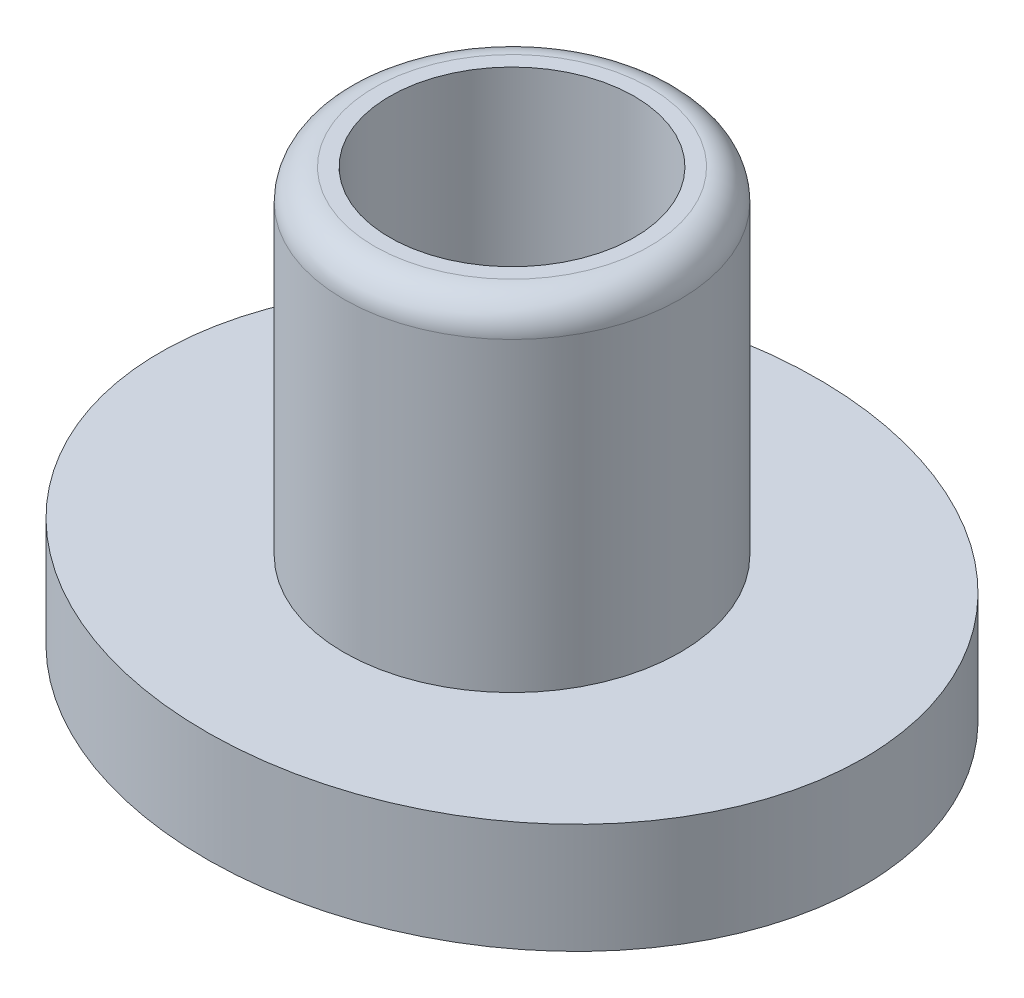
ISO-10303-21;
HEADER;
FILE_DESCRIPTION(('STEP AP214'),'2;1');
FILE_NAME('part.step','',(''),(''),'','','');
FILE_SCHEMA(('AUTOMOTIVE_DESIGN { 1 0 10303 214 1 1 1 1 }'));
ENDSEC;
DATA;
#1=APPLICATION_CONTEXT('core data for automotive mechanical design processes');
#2=APPLICATION_PROTOCOL_DEFINITION('international standard','automotive_design',2000,#1);
#3=PRODUCT_CONTEXT('',#1,'mechanical');
#4=PRODUCT('Part','Part','',(#3));
#5=PRODUCT_RELATED_PRODUCT_CATEGORY('part','',(#4));
#6=PRODUCT_DEFINITION_FORMATION('','',#4);
#7=PRODUCT_DEFINITION_CONTEXT('part definition',#1,'design');
#8=PRODUCT_DEFINITION('design','',#6,#7);
#9=PRODUCT_DEFINITION_SHAPE('','',#8);
#10=(LENGTH_UNIT() NAMED_UNIT(*) SI_UNIT(.MILLI.,.METRE.));
#11=(NAMED_UNIT(*) PLANE_ANGLE_UNIT() SI_UNIT($,.RADIAN.));
#12=(NAMED_UNIT(*) SI_UNIT($,.STERADIAN.) SOLID_ANGLE_UNIT());
#13=UNCERTAINTY_MEASURE_WITH_UNIT(LENGTH_MEASURE(1.E-05),#10,'distance_accuracy_value','');
#14=(GEOMETRIC_REPRESENTATION_CONTEXT(3) GLOBAL_UNCERTAINTY_ASSIGNED_CONTEXT((#13)) GLOBAL_UNIT_ASSIGNED_CONTEXT((#10,
#11,#12)) REPRESENTATION_CONTEXT('',''));
#15=CARTESIAN_POINT('',(0.,0.,0.));
#16=DIRECTION('',(0.,0.,1.));
#17=DIRECTION('',(1.,0.,0.));
#18=AXIS2_PLACEMENT_3D('',#15,#16,#17);
#19=CARTESIAN_POINT('',(0.,1.8,0.));
#20=DIRECTION('',(0.,1.,0.));
#21=DIRECTION('',(0.,0.,-1.));
#22=AXIS2_PLACEMENT_3D('',#19,#20,#21);
#23=PLANE('',#22);
#24=CARTESIAN_POINT('',(0.,1.8,0.));
#25=DIRECTION('',(0.,-1.,0.));
#26=DIRECTION('',(1.,0.,0.));
#27=AXIS2_PLACEMENT_3D('',#24,#25,#26);
#28=ELLIPSE('',#27,5.75,5.);
#29=CARTESIAN_POINT('',(5.75,1.8,0.));
#30=VERTEX_POINT('',#29);
#31=EDGE_CURVE('E53',#30,#30,#28,.T.);
#32=ORIENTED_EDGE('',*,*,#31,.F.);
#33=EDGE_LOOP('',(#32));
#34=FACE_BOUND('',#33,.T.);
#35=CARTESIAN_POINT('',(0.,1.8,0.));
#36=DIRECTION('',(0.,-1.,0.));
#37=DIRECTION('',(0.,0.,-1.));
#38=AXIS2_PLACEMENT_3D('',#35,#36,#37);
#39=CIRCLE('',#38,2.75);
#40=CARTESIAN_POINT('',(0.,1.8,-2.75));
#41=VERTEX_POINT('',#40);
#42=EDGE_CURVE('E57',#41,#41,#39,.T.);
#43=ORIENTED_EDGE('',*,*,#42,.T.);
#44=EDGE_LOOP('',(#43));
#45=FACE_BOUND('',#44,.T.);
#46=ADVANCED_FACE('F33',(#34,#45),#23,.T.);
#47=DIRECTION('',(0.,-1.,0.));
#48=VECTOR('',#47,1.);
#49=SURFACE_OF_LINEAR_EXTRUSION('',#28,#48);
#50=ORIENTED_EDGE('',*,*,#31,.T.);
#51=EDGE_LOOP('',(#50));
#52=FACE_BOUND('',#51,.T.);
#53=CARTESIAN_POINT('',(0.,0.,0.));
#54=DIRECTION('',(0.,-1.,0.));
#55=DIRECTION('',(1.,0.,0.));
#56=AXIS2_PLACEMENT_3D('',#53,#54,#55);
#57=ELLIPSE('',#56,5.75,5.);
#58=CARTESIAN_POINT('',(5.75,0.,0.));
#59=VERTEX_POINT('',#58);
#60=EDGE_CURVE('E54',#59,#59,#57,.T.);
#61=ORIENTED_EDGE('',*,*,#60,.F.);
#62=EDGE_LOOP('',(#61));
#63=FACE_BOUND('',#62,.T.);
#64=ADVANCED_FACE('F63',(#52,#63),#49,.T.);
#65=CARTESIAN_POINT('',(0.,0.,0.));
#66=DIRECTION('',(0.,1.,0.));
#67=DIRECTION('',(0.,0.,-1.));
#68=AXIS2_PLACEMENT_3D('',#65,#66,#67);
#69=PLANE('',#68);
#70=CARTESIAN_POINT('',(0.,0.,0.));
#71=DIRECTION('',(0.,-1.,0.));
#72=DIRECTION('',(0.,0.,-1.));
#73=AXIS2_PLACEMENT_3D('',#70,#71,#72);
#74=CIRCLE('',#73,2.25);
#75=CARTESIAN_POINT('',(0.,0.,-2.25));
#76=VERTEX_POINT('',#75);
#77=EDGE_CURVE('E48',#76,#76,#74,.T.);
#78=ORIENTED_EDGE('',*,*,#77,.F.);
#79=EDGE_LOOP('',(#78));
#80=FACE_BOUND('',#79,.T.);
#81=ORIENTED_EDGE('',*,*,#60,.T.);
#82=EDGE_LOOP('',(#81));
#83=FACE_BOUND('',#82,.T.);
#84=ADVANCED_FACE('F66',(#80,#83),#69,.F.);
#85=CARTESIAN_POINT('',(0.,7.3,0.));
#86=DIRECTION('',(0.,-1.,0.));
#87=DIRECTION('',(0.,0.,1.));
#88=AXIS2_PLACEMENT_3D('',#85,#86,#87);
#89=CYLINDRICAL_SURFACE('',#88,2.75);
#90=CARTESIAN_POINT('',(0.,6.8,0.));
#91=DIRECTION('',(0.,-1.,0.));
#92=DIRECTION('',(0.,0.,-1.));
#93=AXIS2_PLACEMENT_3D('',#90,#91,#92);
#94=CIRCLE('',#93,2.75);
#95=CARTESIAN_POINT('',(0.,6.8,-2.75));
#96=VERTEX_POINT('',#95);
#97=EDGE_CURVE('E10',#96,#96,#94,.F.);
#98=ORIENTED_EDGE('',*,*,#97,.F.);
#99=EDGE_LOOP('',(#98));
#100=FACE_BOUND('',#99,.T.);
#101=ORIENTED_EDGE('',*,*,#42,.F.);
#102=EDGE_LOOP('',(#101));
#103=FACE_BOUND('',#102,.T.);
#104=ADVANCED_FACE('F88',(#100,#103),#89,.T.);
#105=CARTESIAN_POINT('',(0.,7.3,0.));
#106=DIRECTION('',(0.,1.,0.));
#107=DIRECTION('',(0.,0.,-1.));
#108=AXIS2_PLACEMENT_3D('',#105,#106,#107);
#109=PLANE('',#108);
#110=CARTESIAN_POINT('',(0.,7.3,0.));
#111=DIRECTION('',(0.,-1.,0.));
#112=DIRECTION('',(0.,0.,-1.));
#113=AXIS2_PLACEMENT_3D('',#110,#111,#112);
#114=CIRCLE('',#113,2.25);
#115=CARTESIAN_POINT('',(0.,7.3,-2.25));
#116=VERTEX_POINT('',#115);
#117=EDGE_CURVE('E40',#116,#116,#114,.T.);
#118=ORIENTED_EDGE('',*,*,#117,.F.);
#119=EDGE_LOOP('',(#118));
#120=FACE_BOUND('',#119,.T.);
#121=CARTESIAN_POINT('',(0.,7.3,0.));
#122=DIRECTION('',(0.,-1.,0.));
#123=DIRECTION('',(0.,0.,-1.));
#124=AXIS2_PLACEMENT_3D('',#121,#122,#123);
#125=CIRCLE('',#124,2.);
#126=CARTESIAN_POINT('',(0.,7.3,-2.));
#127=VERTEX_POINT('',#126);
#128=EDGE_CURVE('E99',#127,#127,#125,.T.);
#129=ORIENTED_EDGE('',*,*,#128,.T.);
#130=EDGE_LOOP('',(#129));
#131=FACE_BOUND('',#130,.T.);
#132=ADVANCED_FACE('F77',(#120,#131),#109,.T.);
#133=CARTESIAN_POINT('',(0.,0.,0.));
#134=DIRECTION('',(0.,1.,0.));
#135=DIRECTION('',(0.,0.,-1.));
#136=AXIS2_PLACEMENT_3D('',#133,#134,#135);
#137=CYLINDRICAL_SURFACE('',#136,2.);
#138=CARTESIAN_POINT('',(0.,0.25,0.));
#139=DIRECTION('',(0.,-1.,0.));
#140=DIRECTION('',(0.,0.,-1.));
#141=AXIS2_PLACEMENT_3D('',#138,#139,#140);
#142=CIRCLE('',#141,2.);
#143=CARTESIAN_POINT('',(0.,0.25,-2.));
#144=VERTEX_POINT('',#143);
#145=EDGE_CURVE('E44',#144,#144,#142,.F.);
#146=ORIENTED_EDGE('',*,*,#145,.F.);
#147=EDGE_LOOP('',(#146));
#148=FACE_BOUND('',#147,.T.);
#149=ORIENTED_EDGE('',*,*,#128,.F.);
#150=EDGE_LOOP('',(#149));
#151=FACE_BOUND('',#150,.T.);
#152=ADVANCED_FACE('F71',(#148,#151),#137,.F.);
#153=CARTESIAN_POINT('',(0.,0.25,0.));
#154=DIRECTION('',(0.,1.,0.));
#155=DIRECTION('',(0.,0.,-1.));
#156=AXIS2_PLACEMENT_3D('',#153,#154,#155);
#157=TOROIDAL_SURFACE('',#156,2.25,0.25);
#158=ORIENTED_EDGE('',*,*,#145,.T.);
#159=EDGE_LOOP('',(#158));
#160=FACE_BOUND('',#159,.T.);
#161=ORIENTED_EDGE('',*,*,#77,.T.);
#162=EDGE_LOOP('',(#161));
#163=FACE_BOUND('',#162,.T.);
#164=ADVANCED_FACE('F69',(#160,#163),#157,.T.);
#165=CARTESIAN_POINT('',(0.,6.8,0.));
#166=DIRECTION('',(0.,1.,0.));
#167=DIRECTION('',(0.,0.,-1.));
#168=AXIS2_PLACEMENT_3D('',#165,#166,#167);
#169=TOROIDAL_SURFACE('',#168,2.25,0.5);
#170=ORIENTED_EDGE('',*,*,#97,.T.);
#171=EDGE_LOOP('',(#170));
#172=FACE_BOUND('',#171,.T.);
#173=ORIENTED_EDGE('',*,*,#117,.T.);
#174=EDGE_LOOP('',(#173));
#175=FACE_BOUND('',#174,.T.);
#176=ADVANCED_FACE('F35',(#172,#175),#169,.T.);
#177=CLOSED_SHELL('',(#46,#64,#84,#104,#132,#152,#164,#176));
#178=MANIFOLD_SOLID_BREP('B2',#177);
#179=ADVANCED_BREP_SHAPE_REPRESENTATION('',(#18,#178),#14);
#180=SHAPE_DEFINITION_REPRESENTATION(#9,#179);
ENDSEC;
END-ISO-10303-21;
